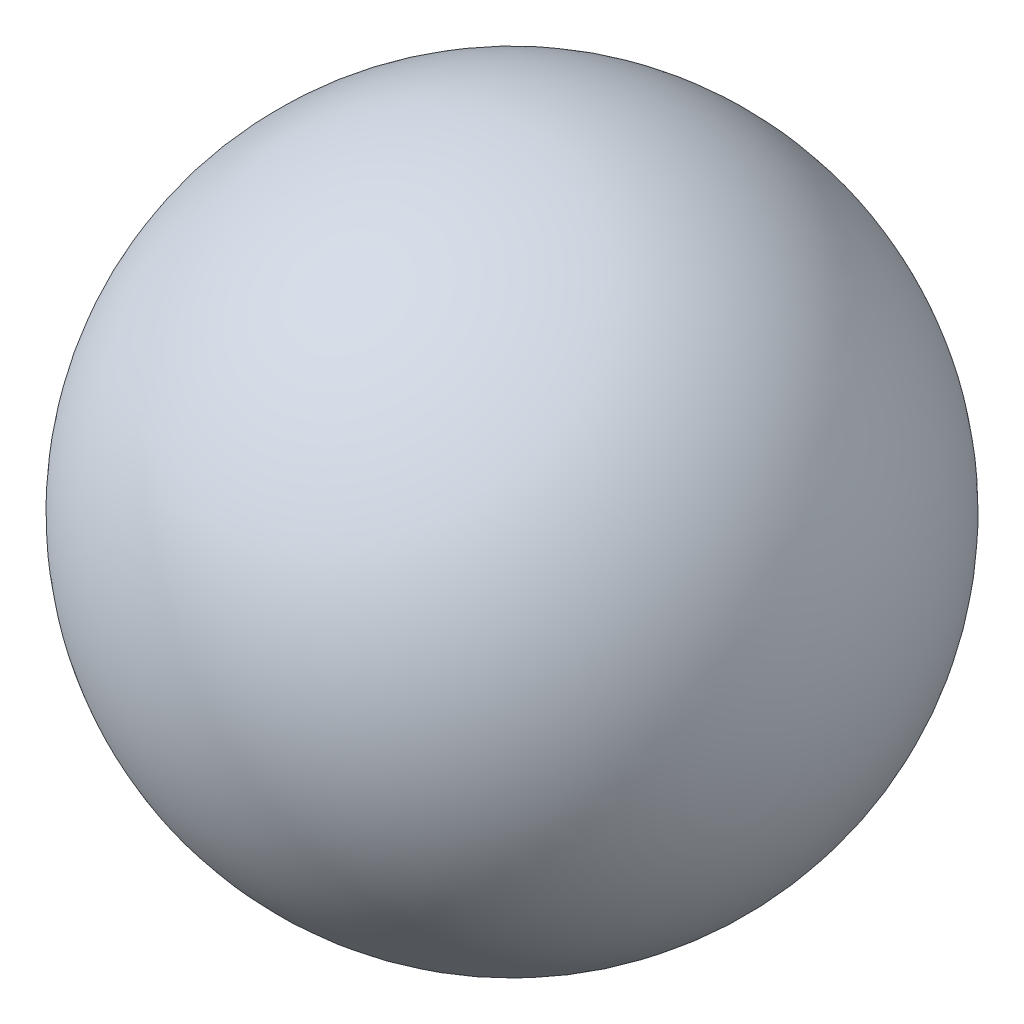
ISO-10303-21;
HEADER;
FILE_DESCRIPTION(('STEP AP214'),'2;1');
FILE_NAME('part.step','',(''),(''),'','','');
FILE_SCHEMA(('AUTOMOTIVE_DESIGN { 1 0 10303 214 1 1 1 1 }'));
ENDSEC;
DATA;
#1=APPLICATION_CONTEXT('core data for automotive mechanical design processes');
#2=APPLICATION_PROTOCOL_DEFINITION('international standard','automotive_design',2000,#1);
#3=PRODUCT_CONTEXT('',#1,'mechanical');
#4=PRODUCT('Part','Part','',(#3));
#5=PRODUCT_RELATED_PRODUCT_CATEGORY('part','',(#4));
#6=PRODUCT_DEFINITION_FORMATION('','',#4);
#7=PRODUCT_DEFINITION_CONTEXT('part definition',#1,'design');
#8=PRODUCT_DEFINITION('design','',#6,#7);
#9=PRODUCT_DEFINITION_SHAPE('','',#8);
#10=(LENGTH_UNIT() NAMED_UNIT(*) SI_UNIT(.MILLI.,.METRE.));
#11=(NAMED_UNIT(*) PLANE_ANGLE_UNIT() SI_UNIT($,.RADIAN.));
#12=(NAMED_UNIT(*) SI_UNIT($,.STERADIAN.) SOLID_ANGLE_UNIT());
#13=UNCERTAINTY_MEASURE_WITH_UNIT(LENGTH_MEASURE(1.E-05),#10,'distance_accuracy_value','');
#14=(GEOMETRIC_REPRESENTATION_CONTEXT(3) GLOBAL_UNCERTAINTY_ASSIGNED_CONTEXT((#13)) GLOBAL_UNIT_ASSIGNED_CONTEXT((#10,
#11,#12)) REPRESENTATION_CONTEXT('',''));
#15=CARTESIAN_POINT('',(0.,0.,0.));
#16=DIRECTION('',(0.,0.,1.));
#17=DIRECTION('',(1.,0.,0.));
#18=AXIS2_PLACEMENT_3D('',#15,#16,#17);
#19=CARTESIAN_POINT('',(7.26336808809212,-2.,-9.23612386322775));
#20=DIRECTION('',(0.,0.,1.));
#21=DIRECTION('',(1.,0.,0.));
#22=AXIS2_PLACEMENT_3D('',#19,#20,#21);
#23=SPHERICAL_SURFACE('',#22,1.05);
#24=CARTESIAN_POINT('',(7.26336808809212,-2.,-8.18612386322775));
#25=VERTEX_POINT('',#24);
#26=VERTEX_LOOP('',#25);
#27=FACE_BOUND('',#26,.T.);
#28=ADVANCED_FACE('F12',(#27),#23,.T.);
#29=CLOSED_SHELL('',(#28));
#30=MANIFOLD_SOLID_BREP('B1',#29);
#31=ADVANCED_BREP_SHAPE_REPRESENTATION('',(#18,#30),#14);
#32=SHAPE_DEFINITION_REPRESENTATION(#9,#31);
ENDSEC;
END-ISO-10303-21;
